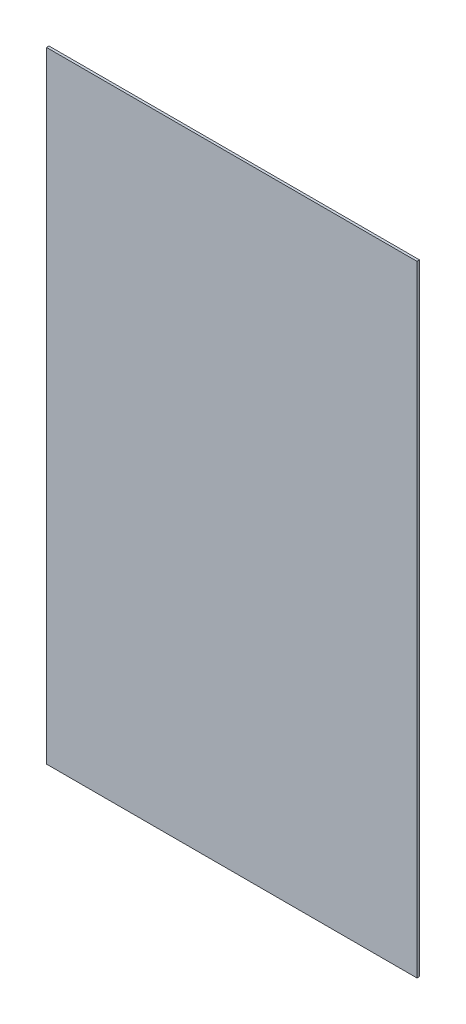
ISO-10303-21;
HEADER;
FILE_DESCRIPTION(('STEP AP214'),'2;1');
FILE_NAME('part.step','',(''),(''),'','','');
FILE_SCHEMA(('AUTOMOTIVE_DESIGN { 1 0 10303 214 1 1 1 1 }'));
ENDSEC;
DATA;
#1=APPLICATION_CONTEXT('core data for automotive mechanical design processes');
#2=APPLICATION_PROTOCOL_DEFINITION('international standard','automotive_design',2000,#1);
#3=PRODUCT_CONTEXT('',#1,'mechanical');
#4=PRODUCT('Part','Part','',(#3));
#5=PRODUCT_RELATED_PRODUCT_CATEGORY('part','',(#4));
#6=PRODUCT_DEFINITION_FORMATION('','',#4);
#7=PRODUCT_DEFINITION_CONTEXT('part definition',#1,'design');
#8=PRODUCT_DEFINITION('design','',#6,#7);
#9=PRODUCT_DEFINITION_SHAPE('','',#8);
#10=(LENGTH_UNIT() NAMED_UNIT(*) SI_UNIT(.MILLI.,.METRE.));
#11=(NAMED_UNIT(*) PLANE_ANGLE_UNIT() SI_UNIT($,.RADIAN.));
#12=(NAMED_UNIT(*) SI_UNIT($,.STERADIAN.) SOLID_ANGLE_UNIT());
#13=UNCERTAINTY_MEASURE_WITH_UNIT(LENGTH_MEASURE(1.E-05),#10,'distance_accuracy_value','');
#14=(GEOMETRIC_REPRESENTATION_CONTEXT(3) GLOBAL_UNCERTAINTY_ASSIGNED_CONTEXT((#13)) GLOBAL_UNIT_ASSIGNED_CONTEXT((#10,
#11,#12)) REPRESENTATION_CONTEXT('',''));
#15=CARTESIAN_POINT('',(0.,0.,0.));
#16=DIRECTION('',(0.,0.,1.));
#17=DIRECTION('',(1.,0.,0.));
#18=AXIS2_PLACEMENT_3D('',#15,#16,#17);
#19=CARTESIAN_POINT('',(-84.0367352196601,278.697874425179,2.));
#20=DIRECTION('',(1.00000000000002,0.,0.));
#21=DIRECTION('',(0.,1.,0.));
#22=AXIS2_PLACEMENT_3D('',#19,#20,#21);
#23=PLANE('',#22);
#24=DIRECTION('',(0.,-1.,0.));
#25=VECTOR('',#24,1.);
#26=CARTESIAN_POINT('',(-84.0367352196601,278.697874425179,0.));
#27=LINE('',#26,#25);
#28=CARTESIAN_POINT('',(-84.0367352196601,278.697874425179,0.));
#29=VERTEX_POINT('',#28);
#30=CARTESIAN_POINT('',(-84.0367352196655,-217.302125574821,0.));
#31=VERTEX_POINT('',#30);
#32=EDGE_CURVE('E97',#29,#31,#27,.T.);
#33=ORIENTED_EDGE('',*,*,#32,.T.);
#34=DIRECTION('',(0.,0.,-1.));
#35=VECTOR('',#34,1.);
#36=CARTESIAN_POINT('',(-84.0367352196655,-217.302125574821,2.));
#37=LINE('',#36,#35);
#38=CARTESIAN_POINT('',(-84.0367352196655,-217.302125574821,2.));
#39=VERTEX_POINT('',#38);
#40=EDGE_CURVE('E11',#39,#31,#37,.T.);
#41=ORIENTED_EDGE('',*,*,#40,.F.);
#42=DIRECTION('',(0.,-1.,0.));
#43=VECTOR('',#42,1.);
#44=CARTESIAN_POINT('',(-84.0367352196601,278.697874425179,2.));
#45=LINE('',#44,#43);
#46=CARTESIAN_POINT('',(-84.0367352196601,278.697874425179,2.));
#47=VERTEX_POINT('',#46);
#48=EDGE_CURVE('E85',#47,#39,#45,.T.);
#49=ORIENTED_EDGE('',*,*,#48,.F.);
#50=DIRECTION('',(0.,0.,-1.));
#51=VECTOR('',#50,1.);
#52=CARTESIAN_POINT('',(-84.0367352196601,278.697874425179,2.));
#53=LINE('',#52,#51);
#54=EDGE_CURVE('E93',#47,#29,#53,.T.);
#55=ORIENTED_EDGE('',*,*,#54,.T.);
#56=EDGE_LOOP('',(#33,#41,#49,#55));
#57=FACE_BOUND('',#56,.T.);
#58=ADVANCED_FACE('F34',(#57),#23,.F.);
#59=CARTESIAN_POINT('',(211.963264780344,-217.302125574821,2.));
#60=DIRECTION('',(0.,1.,0.));
#61=DIRECTION('',(-1.00000000000002,0.,0.));
#62=AXIS2_PLACEMENT_3D('',#59,#60,#61);
#63=PLANE('',#62);
#64=DIRECTION('',(1.00000000000002,0.,0.));
#65=VECTOR('',#64,1.);
#66=CARTESIAN_POINT('',(211.963264780344,-217.302125574821,0.));
#67=LINE('',#66,#65);
#68=CARTESIAN_POINT('',(211.963264780344,-217.302125574821,0.));
#69=VERTEX_POINT('',#68);
#70=EDGE_CURVE('E89',#31,#69,#67,.T.);
#71=ORIENTED_EDGE('',*,*,#70,.T.);
#72=DIRECTION('',(0.,0.,-1.));
#73=VECTOR('',#72,1.);
#74=CARTESIAN_POINT('',(211.963264780344,-217.302125574821,2.));
#75=LINE('',#74,#73);
#76=CARTESIAN_POINT('',(211.963264780344,-217.302125574821,2.));
#77=VERTEX_POINT('',#76);
#78=EDGE_CURVE('E42',#77,#69,#75,.T.);
#79=ORIENTED_EDGE('',*,*,#78,.F.);
#80=DIRECTION('',(1.00000000000002,0.,0.));
#81=VECTOR('',#80,1.);
#82=CARTESIAN_POINT('',(211.963264780344,-217.302125574821,2.));
#83=LINE('',#82,#81);
#84=EDGE_CURVE('E80',#39,#77,#83,.T.);
#85=ORIENTED_EDGE('',*,*,#84,.F.);
#86=ORIENTED_EDGE('',*,*,#40,.T.);
#87=EDGE_LOOP('',(#71,#79,#85,#86));
#88=FACE_BOUND('',#87,.T.);
#89=ADVANCED_FACE('F88',(#88),#63,.F.);
#90=CARTESIAN_POINT('',(211.963264780348,278.697874425179,2.));
#91=DIRECTION('',(-1.00000000000002,0.,0.));
#92=DIRECTION('',(0.,-1.,0.));
#93=AXIS2_PLACEMENT_3D('',#90,#91,#92);
#94=PLANE('',#93);
#95=DIRECTION('',(0.,1.,0.));
#96=VECTOR('',#95,1.);
#97=CARTESIAN_POINT('',(211.963264780348,278.697874425179,0.));
#98=LINE('',#97,#96);
#99=CARTESIAN_POINT('',(211.963264780348,278.697874425179,0.));
#100=VERTEX_POINT('',#99);
#101=EDGE_CURVE('E67',#69,#100,#98,.T.);
#102=ORIENTED_EDGE('',*,*,#101,.T.);
#103=DIRECTION('',(0.,0.,-1.));
#104=VECTOR('',#103,1.);
#105=CARTESIAN_POINT('',(211.963264780348,278.697874425179,2.));
#106=LINE('',#105,#104);
#107=CARTESIAN_POINT('',(211.963264780348,278.697874425179,2.));
#108=VERTEX_POINT('',#107);
#109=EDGE_CURVE('E90',#108,#100,#106,.T.);
#110=ORIENTED_EDGE('',*,*,#109,.F.);
#111=DIRECTION('',(0.,1.,0.));
#112=VECTOR('',#111,1.);
#113=CARTESIAN_POINT('',(211.963264780348,278.697874425179,2.));
#114=LINE('',#113,#112);
#115=EDGE_CURVE('E83',#77,#108,#114,.T.);
#116=ORIENTED_EDGE('',*,*,#115,.F.);
#117=ORIENTED_EDGE('',*,*,#78,.T.);
#118=EDGE_LOOP('',(#102,#110,#116,#117));
#119=FACE_BOUND('',#118,.T.);
#120=ADVANCED_FACE('F91',(#119),#94,.F.);
#121=CARTESIAN_POINT('',(211.963264780348,278.697874425179,2.));
#122=DIRECTION('',(0.,-1.,0.));
#123=DIRECTION('',(1.00000000000002,0.,0.));
#124=AXIS2_PLACEMENT_3D('',#121,#122,#123);
#125=PLANE('',#124);
#126=DIRECTION('',(-1.00000000000002,0.,0.));
#127=VECTOR('',#126,1.);
#128=CARTESIAN_POINT('',(211.963264780348,278.697874425179,0.));
#129=LINE('',#128,#127);
#130=EDGE_CURVE('E73',#100,#29,#129,.T.);
#131=ORIENTED_EDGE('',*,*,#130,.T.);
#132=ORIENTED_EDGE('',*,*,#54,.F.);
#133=DIRECTION('',(-1.00000000000002,0.,0.));
#134=VECTOR('',#133,1.);
#135=CARTESIAN_POINT('',(211.963264780348,278.697874425179,2.));
#136=LINE('',#135,#134);
#137=EDGE_CURVE('E50',#108,#47,#136,.T.);
#138=ORIENTED_EDGE('',*,*,#137,.F.);
#139=ORIENTED_EDGE('',*,*,#109,.T.);
#140=EDGE_LOOP('',(#131,#132,#138,#139));
#141=FACE_BOUND('',#140,.T.);
#142=ADVANCED_FACE('F104',(#141),#125,.F.);
#143=CARTESIAN_POINT('',(0.,0.,2.));
#144=DIRECTION('',(0.,0.,-1.));
#145=DIRECTION('',(-1.00000000000002,0.,0.));
#146=AXIS2_PLACEMENT_3D('',#143,#144,#145);
#147=PLANE('',#146);
#148=ORIENTED_EDGE('',*,*,#48,.T.);
#149=ORIENTED_EDGE('',*,*,#84,.T.);
#150=ORIENTED_EDGE('',*,*,#115,.T.);
#151=ORIENTED_EDGE('',*,*,#137,.T.);
#152=EDGE_LOOP('',(#148,#149,#150,#151));
#153=FACE_BOUND('',#152,.T.);
#154=ADVANCED_FACE('F81',(#153),#147,.F.);
#155=CARTESIAN_POINT('',(0.,0.,0.));
#156=DIRECTION('',(0.,0.,-1.));
#157=DIRECTION('',(-1.00000000000002,0.,0.));
#158=AXIS2_PLACEMENT_3D('',#155,#156,#157);
#159=PLANE('',#158);
#160=ORIENTED_EDGE('',*,*,#32,.F.);
#161=ORIENTED_EDGE('',*,*,#130,.F.);
#162=ORIENTED_EDGE('',*,*,#101,.F.);
#163=ORIENTED_EDGE('',*,*,#70,.F.);
#164=EDGE_LOOP('',(#160,#161,#162,#163));
#165=FACE_BOUND('',#164,.T.);
#166=ADVANCED_FACE('F107',(#165),#159,.T.);
#167=CLOSED_SHELL('',(#58,#89,#120,#142,#154,#166));
#168=MANIFOLD_SOLID_BREP('B2',#167);
#169=ADVANCED_BREP_SHAPE_REPRESENTATION('',(#18,#168),#14);
#170=SHAPE_DEFINITION_REPRESENTATION(#9,#169);
ENDSEC;
END-ISO-10303-21;
